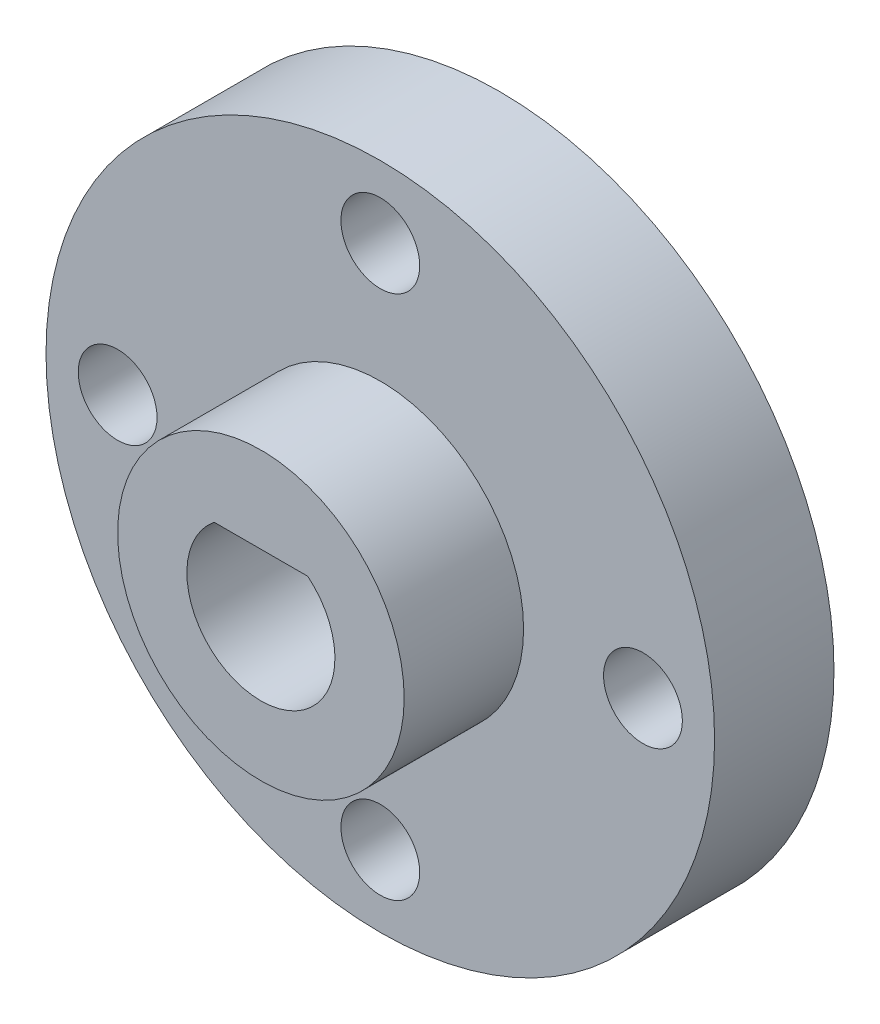
ISO-10303-21;
HEADER;
FILE_DESCRIPTION(('STEP AP214'),'2;1');
FILE_NAME('part.step','',(''),(''),'','','');
FILE_SCHEMA(('AUTOMOTIVE_DESIGN { 1 0 10303 214 1 1 1 1 }'));
ENDSEC;
DATA;
#1=APPLICATION_CONTEXT('core data for automotive mechanical design processes');
#2=APPLICATION_PROTOCOL_DEFINITION('international standard','automotive_design',2000,#1);
#3=PRODUCT_CONTEXT('',#1,'mechanical');
#4=PRODUCT('Part','Part','',(#3));
#5=PRODUCT_RELATED_PRODUCT_CATEGORY('part','',(#4));
#6=PRODUCT_DEFINITION_FORMATION('','',#4);
#7=PRODUCT_DEFINITION_CONTEXT('part definition',#1,'design');
#8=PRODUCT_DEFINITION('design','',#6,#7);
#9=PRODUCT_DEFINITION_SHAPE('','',#8);
#10=(LENGTH_UNIT() NAMED_UNIT(*) SI_UNIT(.MILLI.,.METRE.));
#11=(NAMED_UNIT(*) PLANE_ANGLE_UNIT() SI_UNIT($,.RADIAN.));
#12=(NAMED_UNIT(*) SI_UNIT($,.STERADIAN.) SOLID_ANGLE_UNIT());
#13=UNCERTAINTY_MEASURE_WITH_UNIT(LENGTH_MEASURE(1.E-05),#10,'distance_accuracy_value','');
#14=(GEOMETRIC_REPRESENTATION_CONTEXT(3) GLOBAL_UNCERTAINTY_ASSIGNED_CONTEXT((#13)) GLOBAL_UNIT_ASSIGNED_CONTEXT((#10,
#11,#12)) REPRESENTATION_CONTEXT('',''));
#15=CARTESIAN_POINT('',(0.,0.,0.));
#16=DIRECTION('',(0.,0.,1.));
#17=DIRECTION('',(1.,0.,0.));
#18=AXIS2_PLACEMENT_3D('',#15,#16,#17);
#19=CARTESIAN_POINT('',(0.,0.,5.));
#20=DIRECTION('',(0.,0.,1.));
#21=DIRECTION('',(1.,0.,0.));
#22=AXIS2_PLACEMENT_3D('',#19,#20,#21);
#23=PLANE('',#22);
#24=CARTESIAN_POINT('',(0.,0.,5.));
#25=DIRECTION('',(0.,0.,1.));
#26=DIRECTION('',(1.,0.,0.));
#27=AXIS2_PLACEMENT_3D('',#24,#25,#26);
#28=CIRCLE('',#27,6.);
#29=CARTESIAN_POINT('',(6.,0.,5.));
#30=VERTEX_POINT('',#29);
#31=EDGE_CURVE('E70',#30,#30,#28,.T.);
#32=ORIENTED_EDGE('',*,*,#31,.F.);
#33=EDGE_LOOP('',(#32));
#34=FACE_BOUND('',#33,.T.);
#35=CARTESIAN_POINT('',(0.,-11.,5.));
#36=DIRECTION('',(0.,0.,1.));
#37=DIRECTION('',(1.,0.,0.));
#38=AXIS2_PLACEMENT_3D('',#35,#36,#37);
#39=CIRCLE('',#38,1.65);
#40=CARTESIAN_POINT('',(1.65,-11.,5.));
#41=VERTEX_POINT('',#40);
#42=EDGE_CURVE('E98',#41,#41,#39,.T.);
#43=ORIENTED_EDGE('',*,*,#42,.F.);
#44=EDGE_LOOP('',(#43));
#45=FACE_BOUND('',#44,.T.);
#46=CARTESIAN_POINT('',(0.,11.,5.));
#47=DIRECTION('',(0.,0.,1.));
#48=DIRECTION('',(1.,0.,0.));
#49=AXIS2_PLACEMENT_3D('',#46,#47,#48);
#50=CIRCLE('',#49,1.65);
#51=CARTESIAN_POINT('',(1.65,11.,5.));
#52=VERTEX_POINT('',#51);
#53=EDGE_CURVE('E110',#52,#52,#50,.T.);
#54=ORIENTED_EDGE('',*,*,#53,.F.);
#55=EDGE_LOOP('',(#54));
#56=FACE_BOUND('',#55,.T.);
#57=CARTESIAN_POINT('',(0.,0.,5.));
#58=DIRECTION('',(0.,0.,1.));
#59=DIRECTION('',(1.,0.,0.));
#60=AXIS2_PLACEMENT_3D('',#57,#58,#59);
#61=CIRCLE('',#60,14.);
#62=CARTESIAN_POINT('',(14.,0.,5.));
#63=VERTEX_POINT('',#62);
#64=EDGE_CURVE('E11',#63,#63,#61,.T.);
#65=ORIENTED_EDGE('',*,*,#64,.T.);
#66=EDGE_LOOP('',(#65));
#67=FACE_BOUND('',#66,.T.);
#68=CARTESIAN_POINT('',(11.,0.,5.));
#69=DIRECTION('',(0.,0.,1.));
#70=DIRECTION('',(1.,0.,0.));
#71=AXIS2_PLACEMENT_3D('',#68,#69,#70);
#72=CIRCLE('',#71,1.65);
#73=CARTESIAN_POINT('',(12.65,0.,5.));
#74=VERTEX_POINT('',#73);
#75=EDGE_CURVE('E104',#74,#74,#72,.T.);
#76=ORIENTED_EDGE('',*,*,#75,.F.);
#77=EDGE_LOOP('',(#76));
#78=FACE_BOUND('',#77,.T.);
#79=CARTESIAN_POINT('',(-11.,0.,5.));
#80=DIRECTION('',(0.,0.,1.));
#81=DIRECTION('',(1.,0.,0.));
#82=AXIS2_PLACEMENT_3D('',#79,#80,#81);
#83=CIRCLE('',#82,1.65);
#84=CARTESIAN_POINT('',(-9.35,0.,5.));
#85=VERTEX_POINT('',#84);
#86=EDGE_CURVE('E92',#85,#85,#83,.T.);
#87=ORIENTED_EDGE('',*,*,#86,.F.);
#88=EDGE_LOOP('',(#87));
#89=FACE_BOUND('',#88,.T.);
#90=ADVANCED_FACE('F39',(#34,#45,#56,#67,#78,#89),#23,.T.);
#91=CARTESIAN_POINT('',(0.,0.,0.));
#92=DIRECTION('',(0.,0.,1.));
#93=DIRECTION('',(1.,0.,0.));
#94=AXIS2_PLACEMENT_3D('',#91,#92,#93);
#95=PLANE('',#94);
#96=DIRECTION('',(-1.,0.,0.));
#97=VECTOR('',#96,1.);
#98=CARTESIAN_POINT('',(-1.96214168703486,2.4,0.));
#99=LINE('',#98,#97);
#100=CARTESIAN_POINT('',(1.96214168703486,2.4,0.));
#101=VERTEX_POINT('',#100);
#102=CARTESIAN_POINT('',(-1.96214168703486,2.4,0.));
#103=VERTEX_POINT('',#102);
#104=EDGE_CURVE('E82',#101,#103,#99,.T.);
#105=ORIENTED_EDGE('',*,*,#104,.T.);
#106=CARTESIAN_POINT('',(0.,0.,0.));
#107=DIRECTION('',(0.,0.,1.));
#108=DIRECTION('',(1.,0.,0.));
#109=AXIS2_PLACEMENT_3D('',#106,#107,#108);
#110=CIRCLE('',#109,3.1);
#111=EDGE_CURVE('E54',#103,#101,#110,.T.);
#112=ORIENTED_EDGE('',*,*,#111,.T.);
#113=EDGE_LOOP('',(#105,#112));
#114=FACE_BOUND('',#113,.T.);
#115=CARTESIAN_POINT('',(0.,0.,0.));
#116=DIRECTION('',(0.,0.,1.));
#117=DIRECTION('',(1.,0.,0.));
#118=AXIS2_PLACEMENT_3D('',#115,#116,#117);
#119=CIRCLE('',#118,14.);
#120=CARTESIAN_POINT('',(14.,0.,0.));
#121=VERTEX_POINT('',#120);
#122=EDGE_CURVE('E43',#121,#121,#119,.T.);
#123=ORIENTED_EDGE('',*,*,#122,.F.);
#124=EDGE_LOOP('',(#123));
#125=FACE_BOUND('',#124,.T.);
#126=CARTESIAN_POINT('',(0.,11.,0.));
#127=DIRECTION('',(0.,0.,1.));
#128=DIRECTION('',(1.,0.,0.));
#129=AXIS2_PLACEMENT_3D('',#126,#127,#128);
#130=CIRCLE('',#129,1.65);
#131=CARTESIAN_POINT('',(1.65,11.,0.));
#132=VERTEX_POINT('',#131);
#133=EDGE_CURVE('E107',#132,#132,#130,.T.);
#134=ORIENTED_EDGE('',*,*,#133,.T.);
#135=EDGE_LOOP('',(#134));
#136=FACE_BOUND('',#135,.T.);
#137=CARTESIAN_POINT('',(11.,0.,0.));
#138=DIRECTION('',(0.,0.,1.));
#139=DIRECTION('',(1.,0.,0.));
#140=AXIS2_PLACEMENT_3D('',#137,#138,#139);
#141=CIRCLE('',#140,1.65);
#142=CARTESIAN_POINT('',(12.65,0.,0.));
#143=VERTEX_POINT('',#142);
#144=EDGE_CURVE('E101',#143,#143,#141,.T.);
#145=ORIENTED_EDGE('',*,*,#144,.T.);
#146=EDGE_LOOP('',(#145));
#147=FACE_BOUND('',#146,.T.);
#148=CARTESIAN_POINT('',(0.,-11.,0.));
#149=DIRECTION('',(0.,0.,1.));
#150=DIRECTION('',(1.,0.,0.));
#151=AXIS2_PLACEMENT_3D('',#148,#149,#150);
#152=CIRCLE('',#151,1.65);
#153=CARTESIAN_POINT('',(1.65,-11.,0.));
#154=VERTEX_POINT('',#153);
#155=EDGE_CURVE('E95',#154,#154,#152,.T.);
#156=ORIENTED_EDGE('',*,*,#155,.T.);
#157=EDGE_LOOP('',(#156));
#158=FACE_BOUND('',#157,.T.);
#159=CARTESIAN_POINT('',(-11.,0.,0.));
#160=DIRECTION('',(0.,0.,1.));
#161=DIRECTION('',(1.,0.,0.));
#162=AXIS2_PLACEMENT_3D('',#159,#160,#161);
#163=CIRCLE('',#162,1.65);
#164=CARTESIAN_POINT('',(-9.35,0.,0.));
#165=VERTEX_POINT('',#164);
#166=EDGE_CURVE('E89',#165,#165,#163,.T.);
#167=ORIENTED_EDGE('',*,*,#166,.T.);
#168=EDGE_LOOP('',(#167));
#169=FACE_BOUND('',#168,.T.);
#170=ADVANCED_FACE('F116',(#114,#125,#136,#147,#158,#169),#95,.F.);
#171=CARTESIAN_POINT('',(0.,0.,5.));
#172=DIRECTION('',(0.,0.,-1.));
#173=DIRECTION('',(-1.,0.,0.));
#174=AXIS2_PLACEMENT_3D('',#171,#172,#173);
#175=CYLINDRICAL_SURFACE('',#174,14.);
#176=ORIENTED_EDGE('',*,*,#64,.F.);
#177=EDGE_LOOP('',(#176));
#178=FACE_BOUND('',#177,.T.);
#179=ORIENTED_EDGE('',*,*,#122,.T.);
#180=EDGE_LOOP('',(#179));
#181=FACE_BOUND('',#180,.T.);
#182=ADVANCED_FACE('F41',(#178,#181),#175,.T.);
#183=CARTESIAN_POINT('',(0.,11.,5.));
#184=DIRECTION('',(0.,0.,-1.));
#185=DIRECTION('',(-1.,0.,0.));
#186=AXIS2_PLACEMENT_3D('',#183,#184,#185);
#187=CYLINDRICAL_SURFACE('',#186,1.65);
#188=ORIENTED_EDGE('',*,*,#53,.T.);
#189=EDGE_LOOP('',(#188));
#190=FACE_BOUND('',#189,.T.);
#191=ORIENTED_EDGE('',*,*,#133,.F.);
#192=EDGE_LOOP('',(#191));
#193=FACE_BOUND('',#192,.T.);
#194=ADVANCED_FACE('F119',(#190,#193),#187,.F.);
#195=CARTESIAN_POINT('',(11.,0.,5.));
#196=DIRECTION('',(0.,0.,-1.));
#197=DIRECTION('',(-1.,0.,0.));
#198=AXIS2_PLACEMENT_3D('',#195,#196,#197);
#199=CYLINDRICAL_SURFACE('',#198,1.65);
#200=ORIENTED_EDGE('',*,*,#75,.T.);
#201=EDGE_LOOP('',(#200));
#202=FACE_BOUND('',#201,.T.);
#203=ORIENTED_EDGE('',*,*,#144,.F.);
#204=EDGE_LOOP('',(#203));
#205=FACE_BOUND('',#204,.T.);
#206=ADVANCED_FACE('F121',(#202,#205),#199,.F.);
#207=CARTESIAN_POINT('',(0.,-11.,5.));
#208=DIRECTION('',(0.,0.,-1.));
#209=DIRECTION('',(-1.,0.,0.));
#210=AXIS2_PLACEMENT_3D('',#207,#208,#209);
#211=CYLINDRICAL_SURFACE('',#210,1.65);
#212=ORIENTED_EDGE('',*,*,#42,.T.);
#213=EDGE_LOOP('',(#212));
#214=FACE_BOUND('',#213,.T.);
#215=ORIENTED_EDGE('',*,*,#155,.F.);
#216=EDGE_LOOP('',(#215));
#217=FACE_BOUND('',#216,.T.);
#218=ADVANCED_FACE('F128',(#214,#217),#211,.F.);
#219=CARTESIAN_POINT('',(-11.,0.,5.));
#220=DIRECTION('',(0.,0.,-1.));
#221=DIRECTION('',(-1.,0.,0.));
#222=AXIS2_PLACEMENT_3D('',#219,#220,#221);
#223=CYLINDRICAL_SURFACE('',#222,1.65);
#224=ORIENTED_EDGE('',*,*,#86,.T.);
#225=EDGE_LOOP('',(#224));
#226=FACE_BOUND('',#225,.T.);
#227=ORIENTED_EDGE('',*,*,#166,.F.);
#228=EDGE_LOOP('',(#227));
#229=FACE_BOUND('',#228,.T.);
#230=ADVANCED_FACE('F153',(#226,#229),#223,.F.);
#231=CARTESIAN_POINT('',(0.,0.,10.));
#232=DIRECTION('',(0.,0.,-1.));
#233=DIRECTION('',(-1.,0.,0.));
#234=AXIS2_PLACEMENT_3D('',#231,#232,#233);
#235=CYLINDRICAL_SURFACE('',#234,6.);
#236=CARTESIAN_POINT('',(0.,0.,10.));
#237=DIRECTION('',(0.,0.,1.));
#238=DIRECTION('',(1.,0.,0.));
#239=AXIS2_PLACEMENT_3D('',#236,#237,#238);
#240=CIRCLE('',#239,6.);
#241=CARTESIAN_POINT('',(6.,0.,10.));
#242=VERTEX_POINT('',#241);
#243=EDGE_CURVE('E86',#242,#242,#240,.T.);
#244=ORIENTED_EDGE('',*,*,#243,.F.);
#245=EDGE_LOOP('',(#244));
#246=FACE_BOUND('',#245,.T.);
#247=ORIENTED_EDGE('',*,*,#31,.T.);
#248=EDGE_LOOP('',(#247));
#249=FACE_BOUND('',#248,.T.);
#250=ADVANCED_FACE('F155',(#246,#249),#235,.T.);
#251=CARTESIAN_POINT('',(0.,0.,10.));
#252=DIRECTION('',(0.,0.,1.));
#253=DIRECTION('',(1.,0.,0.));
#254=AXIS2_PLACEMENT_3D('',#251,#252,#253);
#255=PLANE('',#254);
#256=CARTESIAN_POINT('',(0.,0.,10.));
#257=DIRECTION('',(0.,0.,1.));
#258=DIRECTION('',(1.,0.,0.));
#259=AXIS2_PLACEMENT_3D('',#256,#257,#258);
#260=CIRCLE('',#259,3.1);
#261=CARTESIAN_POINT('',(-1.96214168703486,2.4,10.));
#262=VERTEX_POINT('',#261);
#263=CARTESIAN_POINT('',(1.96214168703486,2.4,10.));
#264=VERTEX_POINT('',#263);
#265=EDGE_CURVE('E59',#262,#264,#260,.T.);
#266=ORIENTED_EDGE('',*,*,#265,.F.);
#267=DIRECTION('',(-1.,0.,0.));
#268=VECTOR('',#267,1.);
#269=CARTESIAN_POINT('',(-1.96214168703486,2.4,10.));
#270=LINE('',#269,#268);
#271=EDGE_CURVE('E74',#264,#262,#270,.T.);
#272=ORIENTED_EDGE('',*,*,#271,.F.);
#273=EDGE_LOOP('',(#266,#272));
#274=FACE_BOUND('',#273,.T.);
#275=ORIENTED_EDGE('',*,*,#243,.T.);
#276=EDGE_LOOP('',(#275));
#277=FACE_BOUND('',#276,.T.);
#278=ADVANCED_FACE('F78',(#274,#277),#255,.T.);
#279=CARTESIAN_POINT('',(0.,0.,0.));
#280=DIRECTION('',(0.,0.,1.));
#281=DIRECTION('',(1.,0.,0.));
#282=AXIS2_PLACEMENT_3D('',#279,#280,#281);
#283=CYLINDRICAL_SURFACE('',#282,3.1);
#284=ORIENTED_EDGE('',*,*,#265,.T.);
#285=DIRECTION('',(0.,0.,1.));
#286=VECTOR('',#285,1.);
#287=CARTESIAN_POINT('',(1.96214168703486,2.4,0.));
#288=LINE('',#287,#286);
#289=EDGE_CURVE('E71',#101,#264,#288,.T.);
#290=ORIENTED_EDGE('',*,*,#289,.F.);
#291=ORIENTED_EDGE('',*,*,#111,.F.);
#292=DIRECTION('',(0.,0.,1.));
#293=VECTOR('',#292,1.);
#294=CARTESIAN_POINT('',(-1.96214168703486,2.4,0.));
#295=LINE('',#294,#293);
#296=EDGE_CURVE('E64',#103,#262,#295,.T.);
#297=ORIENTED_EDGE('',*,*,#296,.T.);
#298=EDGE_LOOP('',(#284,#290,#291,#297));
#299=FACE_BOUND('',#298,.T.);
#300=ADVANCED_FACE('F66',(#299),#283,.F.);
#301=CARTESIAN_POINT('',(-1.96214168703486,2.4,0.));
#302=DIRECTION('',(0.,1.,0.));
#303=DIRECTION('',(0.,0.,1.));
#304=AXIS2_PLACEMENT_3D('',#301,#302,#303);
#305=PLANE('',#304);
#306=ORIENTED_EDGE('',*,*,#271,.T.);
#307=ORIENTED_EDGE('',*,*,#296,.F.);
#308=ORIENTED_EDGE('',*,*,#104,.F.);
#309=ORIENTED_EDGE('',*,*,#289,.T.);
#310=EDGE_LOOP('',(#306,#307,#308,#309));
#311=FACE_BOUND('',#310,.T.);
#312=ADVANCED_FACE('F75',(#311),#305,.F.);
#313=CLOSED_SHELL('',(#90,#170,#182,#194,#206,#218,#230,#250,#278,#300,#312));
#314=MANIFOLD_SOLID_BREP('B2',#313);
#315=ADVANCED_BREP_SHAPE_REPRESENTATION('',(#18,#314),#14);
#316=SHAPE_DEFINITION_REPRESENTATION(#9,#315);
ENDSEC;
END-ISO-10303-21;
